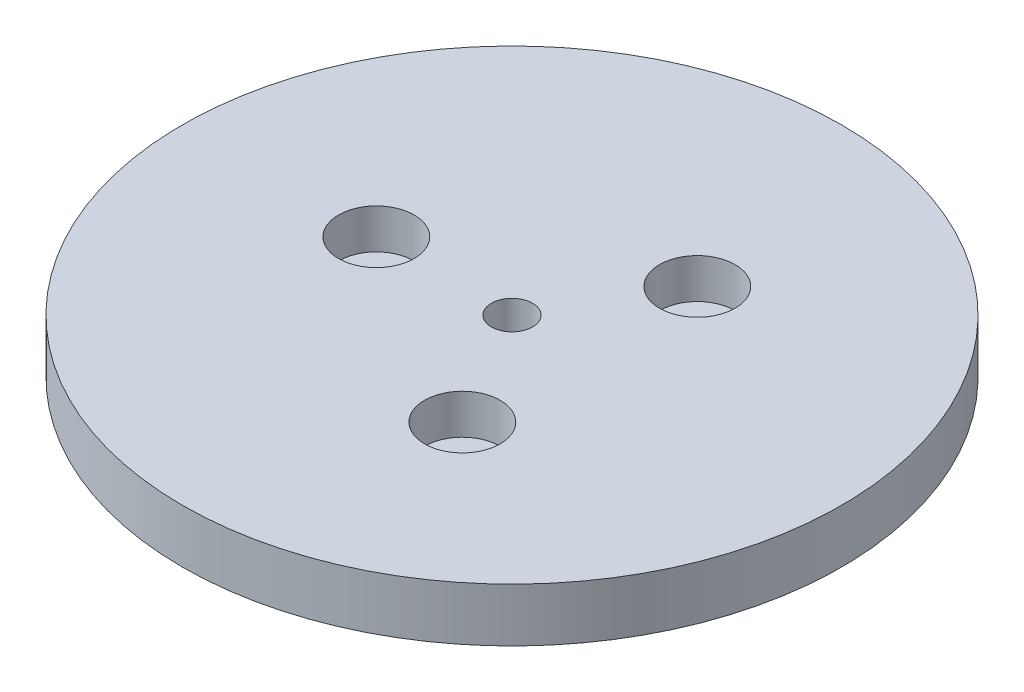
ISO-10303-21;
HEADER;
FILE_DESCRIPTION(('STEP AP214'),'2;1');
FILE_NAME('part.step','',(''),(''),'','','');
FILE_SCHEMA(('AUTOMOTIVE_DESIGN { 1 0 10303 214 1 1 1 1 }'));
ENDSEC;
DATA;
#1=APPLICATION_CONTEXT('core data for automotive mechanical design processes');
#2=APPLICATION_PROTOCOL_DEFINITION('international standard','automotive_design',2000,#1);
#3=PRODUCT_CONTEXT('',#1,'mechanical');
#4=PRODUCT('Part','Part','',(#3));
#5=PRODUCT_RELATED_PRODUCT_CATEGORY('part','',(#4));
#6=PRODUCT_DEFINITION_FORMATION('','',#4);
#7=PRODUCT_DEFINITION_CONTEXT('part definition',#1,'design');
#8=PRODUCT_DEFINITION('design','',#6,#7);
#9=PRODUCT_DEFINITION_SHAPE('','',#8);
#10=(LENGTH_UNIT() NAMED_UNIT(*) SI_UNIT(.MILLI.,.METRE.));
#11=(NAMED_UNIT(*) PLANE_ANGLE_UNIT() SI_UNIT($,.RADIAN.));
#12=(NAMED_UNIT(*) SI_UNIT($,.STERADIAN.) SOLID_ANGLE_UNIT());
#13=UNCERTAINTY_MEASURE_WITH_UNIT(LENGTH_MEASURE(1.E-05),#10,'distance_accuracy_value','');
#14=(GEOMETRIC_REPRESENTATION_CONTEXT(3) GLOBAL_UNCERTAINTY_ASSIGNED_CONTEXT((#13)) GLOBAL_UNIT_ASSIGNED_CONTEXT((#10,
#11,#12)) REPRESENTATION_CONTEXT('',''));
#15=CARTESIAN_POINT('',(0.,0.,0.));
#16=DIRECTION('',(0.,0.,1.));
#17=DIRECTION('',(1.,0.,0.));
#18=AXIS2_PLACEMENT_3D('',#15,#16,#17);
#19=CARTESIAN_POINT('',(0.,13.,0.));
#20=DIRECTION('',(0.,-1.,0.));
#21=DIRECTION('',(0.,0.,-1.));
#22=AXIS2_PLACEMENT_3D('',#19,#20,#21);
#23=CYLINDRICAL_SURFACE('',#22,80.);
#24=CARTESIAN_POINT('',(0.,13.,0.));
#25=DIRECTION('',(0.,1.,0.));
#26=DIRECTION('',(0.,0.,1.));
#27=AXIS2_PLACEMENT_3D('',#24,#25,#26);
#28=CIRCLE('',#27,80.);
#29=CARTESIAN_POINT('',(0.,13.,-80.));
#30=VERTEX_POINT('',#29);
#31=EDGE_CURVE('E10',#30,#30,#28,.T.);
#32=CARTESIAN_POINT('',(0.,0.,0.));
#33=DIRECTION('',(0.,1.,0.));
#34=DIRECTION('',(0.,0.,1.));
#35=AXIS2_PLACEMENT_3D('',#32,#33,#34);
#36=CIRCLE('',#35,80.);
#37=CARTESIAN_POINT('',(0.,0.,-80.));
#38=VERTEX_POINT('',#37);
#39=EDGE_CURVE('E37',#38,#38,#36,.T.);
#40=CARTESIAN_POINT('',(0.,13.,-80.));
#41=CARTESIAN_POINT('',(0.,12.8645833333333,-80.));
#42=CARTESIAN_POINT('',(0.,12.7291666666667,-80.));
#43=CARTESIAN_POINT('',(0.,12.4583333333333,-80.));
#44=CARTESIAN_POINT('',(0.,12.3229166666667,-80.));
#45=CARTESIAN_POINT('',(0.,12.0520833333333,-80.));
#46=CARTESIAN_POINT('',(0.,11.9166666666667,-80.));
#47=CARTESIAN_POINT('',(0.,11.6458333333333,-80.));
#48=CARTESIAN_POINT('',(0.,11.5104166666667,-80.));
#49=CARTESIAN_POINT('',(0.,11.2395833333333,-80.));
#50=CARTESIAN_POINT('',(0.,11.1041666666667,-80.));
#51=CARTESIAN_POINT('',(0.,10.8333333333333,-80.));
#52=CARTESIAN_POINT('',(0.,10.6979166666667,-80.));
#53=CARTESIAN_POINT('',(0.,10.4270833333333,-80.));
#54=CARTESIAN_POINT('',(0.,10.2916666666667,-80.));
#55=CARTESIAN_POINT('',(0.,10.0208333333333,-80.));
#56=CARTESIAN_POINT('',(0.,9.88541666666667,-80.));
#57=CARTESIAN_POINT('',(0.,9.61458333333333,-80.));
#58=CARTESIAN_POINT('',(0.,9.47916666666667,-80.));
#59=CARTESIAN_POINT('',(0.,9.20833333333333,-80.));
#60=CARTESIAN_POINT('',(0.,9.07291666666667,-80.));
#61=CARTESIAN_POINT('',(0.,8.80208333333333,-80.));
#62=CARTESIAN_POINT('',(0.,8.66666666666667,-80.));
#63=CARTESIAN_POINT('',(0.,8.39583333333333,-80.));
#64=CARTESIAN_POINT('',(0.,8.26041666666667,-80.));
#65=CARTESIAN_POINT('',(0.,7.98958333333333,-80.));
#66=CARTESIAN_POINT('',(0.,7.85416666666667,-80.));
#67=CARTESIAN_POINT('',(0.,7.58333333333333,-80.));
#68=CARTESIAN_POINT('',(0.,7.44791666666667,-80.));
#69=CARTESIAN_POINT('',(0.,7.17708333333333,-80.));
#70=CARTESIAN_POINT('',(0.,7.04166666666667,-80.));
#71=CARTESIAN_POINT('',(0.,6.77083333333333,-80.));
#72=CARTESIAN_POINT('',(0.,6.63541666666667,-80.));
#73=CARTESIAN_POINT('',(0.,6.36458333333333,-80.));
#74=CARTESIAN_POINT('',(0.,6.22916666666667,-80.));
#75=CARTESIAN_POINT('',(0.,5.95833333333333,-80.));
#76=CARTESIAN_POINT('',(0.,5.82291666666667,-80.));
#77=CARTESIAN_POINT('',(0.,5.55208333333333,-80.));
#78=CARTESIAN_POINT('',(0.,5.41666666666667,-80.));
#79=CARTESIAN_POINT('',(0.,5.14583333333333,-80.));
#80=CARTESIAN_POINT('',(0.,5.01041666666667,-80.));
#81=CARTESIAN_POINT('',(0.,4.73958333333333,-80.));
#82=CARTESIAN_POINT('',(0.,4.60416666666667,-80.));
#83=CARTESIAN_POINT('',(0.,4.33333333333333,-80.));
#84=CARTESIAN_POINT('',(0.,4.19791666666667,-80.));
#85=CARTESIAN_POINT('',(0.,3.92708333333333,-80.));
#86=CARTESIAN_POINT('',(0.,3.79166666666667,-80.));
#87=CARTESIAN_POINT('',(0.,3.52083333333333,-80.));
#88=CARTESIAN_POINT('',(0.,3.38541666666667,-80.));
#89=CARTESIAN_POINT('',(0.,3.11458333333333,-80.));
#90=CARTESIAN_POINT('',(0.,2.97916666666667,-80.));
#91=CARTESIAN_POINT('',(0.,2.70833333333333,-80.));
#92=CARTESIAN_POINT('',(0.,2.57291666666667,-80.));
#93=CARTESIAN_POINT('',(0.,2.30208333333333,-80.));
#94=CARTESIAN_POINT('',(0.,2.16666666666667,-80.));
#95=CARTESIAN_POINT('',(0.,1.89583333333333,-80.));
#96=CARTESIAN_POINT('',(0.,1.76041666666667,-80.));
#97=CARTESIAN_POINT('',(0.,1.48958333333333,-80.));
#98=CARTESIAN_POINT('',(0.,1.35416666666667,-80.));
#99=CARTESIAN_POINT('',(0.,1.08333333333333,-80.));
#100=CARTESIAN_POINT('',(0.,0.947916666666667,-80.));
#101=CARTESIAN_POINT('',(0.,0.677083333333334,-80.));
#102=CARTESIAN_POINT('',(0.,0.541666666666667,-80.));
#103=CARTESIAN_POINT('',(0.,0.270833333333334,-80.));
#104=CARTESIAN_POINT('',(0.,0.135416666666667,-80.));
#105=CARTESIAN_POINT('',(0.,0.,-80.));
#106=B_SPLINE_CURVE_WITH_KNOTS('',3,(#40,#41,#42,#43,#44,#45,#46,#47,#48,#49,#50,#51,#52,#53,
#54,#55,#56,#57,#58,#59,#60,#61,#62,#63,#64,#65,#66,#67,#68,#69,#70,#71,#72,#73,#74,#75,#76,#77,
#78,#79,#80,#81,#82,#83,#84,#85,#86,#87,#88,#89,#90,#91,#92,#93,#94,#95,#96,#97,#98,#99,#100,
#101,#102,#103,#104,#105),.UNSPECIFIED.,.F.,.F.,(4,2,2,2,2,2,2,2,2,2,2,2,2,2,2,2,2,2,2,2,2,2,2,
2,2,2,2,2,2,2,2,2,4),(0.,0.406249999999999,0.812499999999999,1.21875,1.625,2.03125,2.4375,
2.84375,3.25,3.65625,4.0625,4.46875,4.875,5.28125,5.6875,6.09375,6.5,6.90625,7.3125,7.71875,
8.125,8.53125,8.9375,9.34375,9.75,10.15625,10.5625,10.96875,11.375,11.78125,12.1875,12.59375,
13.),.UNSPECIFIED.);
#107=EDGE_CURVE('BSEAM40',#30,#38,#106,.T.);
#108=ORIENTED_EDGE('',*,*,#31,.F.);
#109=ORIENTED_EDGE('',*,*,#39,.T.);
#110=ORIENTED_EDGE('',*,*,#107,.T.);
#111=ORIENTED_EDGE('',*,*,#107,.F.);
#112=EDGE_LOOP('',(#108,#110,#109,#111));
#113=FACE_BOUND('',#112,.T.);
#114=ADVANCED_FACE('F40',(#113),#23,.T.);
#115=CARTESIAN_POINT('',(0.,13.,0.));
#116=DIRECTION('',(0.,1.,0.));
#117=DIRECTION('',(0.,0.,1.));
#118=AXIS2_PLACEMENT_3D('',#115,#116,#117);
#119=PLANE('',#118);
#120=CARTESIAN_POINT('',(16.4650314159461,13.,28.5182709606361));
#121=DIRECTION('',(0.,1.,0.));
#122=DIRECTION('',(0.866025403784436,0.,-0.500000000000004));
#123=AXIS2_PLACEMENT_3D('',#120,#121,#122);
#124=CIRCLE('',#123,9.17467919291933);
#125=CARTESIAN_POINT('',(24.4105366685867,13.,23.9309313641764));
#126=VERTEX_POINT('',#125);
#127=EDGE_CURVE('E70',#126,#126,#124,.T.);
#128=ORIENTED_EDGE('',*,*,#127,.F.);
#129=EDGE_LOOP('',(#128));
#130=FACE_BOUND('',#129,.T.);
#131=CARTESIAN_POINT('',(16.4650314159457,13.,-28.5182709606363));
#132=DIRECTION('',(0.,1.,0.));
#133=DIRECTION('',(-0.866025403784443,0.,-0.499999999999992));
#134=AXIS2_PLACEMENT_3D('',#131,#132,#133);
#135=CIRCLE('',#134,9.17467919291933);
#136=CARTESIAN_POINT('',(8.519526163305,13.,-33.1056105570959));
#137=VERTEX_POINT('',#136);
#138=EDGE_CURVE('E61',#137,#137,#135,.T.);
#139=ORIENTED_EDGE('',*,*,#138,.F.);
#140=EDGE_LOOP('',(#139));
#141=FACE_BOUND('',#140,.T.);
#142=CARTESIAN_POINT('',(-32.9300628318919,13.,0.));
#143=DIRECTION('',(0.,1.,0.));
#144=DIRECTION('',(0.,0.,1.));
#145=AXIS2_PLACEMENT_3D('',#142,#143,#144);
#146=CIRCLE('',#145,9.17467919291933);
#147=CARTESIAN_POINT('',(-32.9300628318919,13.,9.17467919291933));
#148=VERTEX_POINT('',#147);
#149=EDGE_CURVE('E54',#148,#148,#146,.T.);
#150=ORIENTED_EDGE('',*,*,#149,.F.);
#151=EDGE_LOOP('',(#150));
#152=FACE_BOUND('',#151,.T.);
#153=CARTESIAN_POINT('',(0.,13.,0.));
#154=DIRECTION('',(0.,1.,0.));
#155=DIRECTION('',(0.,0.,1.));
#156=AXIS2_PLACEMENT_3D('',#153,#154,#155);
#157=CIRCLE('',#156,5.);
#158=CARTESIAN_POINT('',(0.,13.,-5.));
#159=VERTEX_POINT('',#158);
#160=EDGE_CURVE('E50',#159,#159,#157,.T.);
#161=ORIENTED_EDGE('',*,*,#160,.F.);
#162=EDGE_LOOP('',(#161));
#163=FACE_BOUND('',#162,.T.);
#164=ORIENTED_EDGE('',*,*,#31,.T.);
#165=EDGE_LOOP('',(#164));
#166=FACE_BOUND('',#165,.T.);
#167=ADVANCED_FACE('F85',(#130,#141,#152,#163,#166),#119,.T.);
#168=CARTESIAN_POINT('',(0.,0.,0.));
#169=DIRECTION('',(0.,1.,0.));
#170=DIRECTION('',(0.,0.,1.));
#171=AXIS2_PLACEMENT_3D('',#168,#169,#170);
#172=PLANE('',#171);
#173=CARTESIAN_POINT('',(0.,0.,0.));
#174=DIRECTION('',(0.,1.,0.));
#175=DIRECTION('',(0.,0.,1.));
#176=AXIS2_PLACEMENT_3D('',#173,#174,#175);
#177=CIRCLE('',#176,5.);
#178=CARTESIAN_POINT('',(0.,0.,-5.));
#179=VERTEX_POINT('',#178);
#180=EDGE_CURVE('E47',#179,#179,#177,.T.);
#181=ORIENTED_EDGE('',*,*,#180,.T.);
#182=EDGE_LOOP('',(#181));
#183=FACE_BOUND('',#182,.T.);
#184=ORIENTED_EDGE('',*,*,#39,.F.);
#185=EDGE_LOOP('',(#184));
#186=FACE_BOUND('',#185,.T.);
#187=ADVANCED_FACE('F84',(#183,#186),#172,.F.);
#188=CARTESIAN_POINT('',(0.,13.,0.));
#189=DIRECTION('',(0.,-1.,0.));
#190=DIRECTION('',(0.,0.,-1.));
#191=AXIS2_PLACEMENT_3D('',#188,#189,#190);
#192=CYLINDRICAL_SURFACE('',#191,5.);
#193=CARTESIAN_POINT('',(0.,13.,-5.));
#194=CARTESIAN_POINT('',(0.,12.8645833333333,-5.));
#195=CARTESIAN_POINT('',(0.,12.7291666666667,-5.));
#196=CARTESIAN_POINT('',(0.,12.4583333333333,-5.));
#197=CARTESIAN_POINT('',(0.,12.3229166666667,-5.));
#198=CARTESIAN_POINT('',(0.,12.0520833333333,-5.));
#199=CARTESIAN_POINT('',(0.,11.9166666666667,-5.));
#200=CARTESIAN_POINT('',(0.,11.6458333333333,-5.));
#201=CARTESIAN_POINT('',(0.,11.5104166666667,-5.));
#202=CARTESIAN_POINT('',(0.,11.2395833333333,-5.));
#203=CARTESIAN_POINT('',(0.,11.1041666666667,-5.));
#204=CARTESIAN_POINT('',(0.,10.8333333333333,-5.));
#205=CARTESIAN_POINT('',(0.,10.6979166666667,-5.));
#206=CARTESIAN_POINT('',(0.,10.4270833333333,-5.));
#207=CARTESIAN_POINT('',(0.,10.2916666666667,-5.));
#208=CARTESIAN_POINT('',(0.,10.0208333333333,-5.));
#209=CARTESIAN_POINT('',(0.,9.88541666666667,-5.));
#210=CARTESIAN_POINT('',(0.,9.61458333333333,-5.));
#211=CARTESIAN_POINT('',(0.,9.47916666666667,-5.));
#212=CARTESIAN_POINT('',(0.,9.20833333333333,-5.));
#213=CARTESIAN_POINT('',(0.,9.07291666666667,-5.));
#214=CARTESIAN_POINT('',(0.,8.80208333333333,-5.));
#215=CARTESIAN_POINT('',(0.,8.66666666666667,-5.));
#216=CARTESIAN_POINT('',(0.,8.39583333333333,-5.));
#217=CARTESIAN_POINT('',(0.,8.26041666666667,-5.));
#218=CARTESIAN_POINT('',(0.,7.98958333333333,-5.));
#219=CARTESIAN_POINT('',(0.,7.85416666666667,-5.));
#220=CARTESIAN_POINT('',(0.,7.58333333333333,-5.));
#221=CARTESIAN_POINT('',(0.,7.44791666666667,-5.));
#222=CARTESIAN_POINT('',(0.,7.17708333333333,-5.));
#223=CARTESIAN_POINT('',(0.,7.04166666666667,-5.));
#224=CARTESIAN_POINT('',(0.,6.77083333333333,-5.));
#225=CARTESIAN_POINT('',(0.,6.63541666666667,-5.));
#226=CARTESIAN_POINT('',(0.,6.36458333333333,-5.));
#227=CARTESIAN_POINT('',(0.,6.22916666666667,-5.));
#228=CARTESIAN_POINT('',(0.,5.95833333333333,-5.));
#229=CARTESIAN_POINT('',(0.,5.82291666666667,-5.));
#230=CARTESIAN_POINT('',(0.,5.55208333333333,-5.));
#231=CARTESIAN_POINT('',(0.,5.41666666666667,-5.));
#232=CARTESIAN_POINT('',(0.,5.14583333333333,-5.));
#233=CARTESIAN_POINT('',(0.,5.01041666666667,-5.));
#234=CARTESIAN_POINT('',(0.,4.73958333333333,-5.));
#235=CARTESIAN_POINT('',(0.,4.60416666666667,-5.));
#236=CARTESIAN_POINT('',(0.,4.33333333333333,-5.));
#237=CARTESIAN_POINT('',(0.,4.19791666666667,-5.));
#238=CARTESIAN_POINT('',(0.,3.92708333333333,-5.));
#239=CARTESIAN_POINT('',(0.,3.79166666666667,-5.));
#240=CARTESIAN_POINT('',(0.,3.52083333333333,-5.));
#241=CARTESIAN_POINT('',(0.,3.38541666666667,-5.));
#242=CARTESIAN_POINT('',(0.,3.11458333333333,-5.));
#243=CARTESIAN_POINT('',(0.,2.97916666666667,-5.));
#244=CARTESIAN_POINT('',(0.,2.70833333333333,-5.));
#245=CARTESIAN_POINT('',(0.,2.57291666666667,-5.));
#246=CARTESIAN_POINT('',(0.,2.30208333333333,-5.));
#247=CARTESIAN_POINT('',(0.,2.16666666666667,-5.));
#248=CARTESIAN_POINT('',(0.,1.89583333333333,-5.));
#249=CARTESIAN_POINT('',(0.,1.76041666666667,-5.));
#250=CARTESIAN_POINT('',(0.,1.48958333333333,-5.));
#251=CARTESIAN_POINT('',(0.,1.35416666666667,-5.));
#252=CARTESIAN_POINT('',(0.,1.08333333333333,-5.));
#253=CARTESIAN_POINT('',(0.,0.947916666666667,-5.));
#254=CARTESIAN_POINT('',(0.,0.677083333333334,-5.));
#255=CARTESIAN_POINT('',(0.,0.541666666666667,-5.));
#256=CARTESIAN_POINT('',(0.,0.270833333333334,-5.));
#257=CARTESIAN_POINT('',(0.,0.135416666666667,-5.));
#258=CARTESIAN_POINT('',(0.,0.,-5.));
#259=B_SPLINE_CURVE_WITH_KNOTS('',3,(#193,#194,#195,#196,#197,#198,#199,#200,#201,#202,#203,
#204,#205,#206,#207,#208,#209,#210,#211,#212,#213,#214,#215,#216,#217,#218,#219,#220,#221,#222,
#223,#224,#225,#226,#227,#228,#229,#230,#231,#232,#233,#234,#235,#236,#237,#238,#239,#240,#241,
#242,#243,#244,#245,#246,#247,#248,#249,#250,#251,#252,#253,#254,#255,#256,#257,#258),
.UNSPECIFIED.,.F.,.F.,(4,2,2,2,2,2,2,2,2,2,2,2,2,2,2,2,2,2,2,2,2,2,2,2,2,2,2,2,2,2,2,2,4),(0.,
0.406249999999999,0.812499999999999,1.21875,1.625,2.03125,2.4375,2.84375,3.25,3.65625,4.0625,
4.46875,4.875,5.28125,5.6875,6.09375,6.5,6.90625,7.3125,7.71875,8.125,8.53125,8.9375,9.34375,
9.75,10.15625,10.5625,10.96875,11.375,11.78125,12.1875,12.59375,13.),.UNSPECIFIED.);
#260=EDGE_CURVE('BSEAM91',#159,#179,#259,.T.);
#261=ORIENTED_EDGE('',*,*,#160,.T.);
#262=ORIENTED_EDGE('',*,*,#180,.F.);
#263=ORIENTED_EDGE('',*,*,#260,.T.);
#264=ORIENTED_EDGE('',*,*,#260,.F.);
#265=EDGE_LOOP('',(#261,#263,#262,#264));
#266=FACE_BOUND('',#265,.T.);
#267=ADVANCED_FACE('F91',(#266),#192,.F.);
#268=CARTESIAN_POINT('',(-32.9300628318919,3.33120211531361,0.));
#269=DIRECTION('',(0.,1.,0.));
#270=DIRECTION('',(0.,0.,1.));
#271=AXIS2_PLACEMENT_3D('',#268,#269,#270);
#272=CYLINDRICAL_SURFACE('',#271,9.17467919291933);
#273=CARTESIAN_POINT('',(-32.9300628318919,3.33120211531361,0.));
#274=DIRECTION('',(0.,1.,0.));
#275=DIRECTION('',(0.,0.,1.));
#276=AXIS2_PLACEMENT_3D('',#273,#274,#275);
#277=CIRCLE('',#276,9.17467919291933);
#278=CARTESIAN_POINT('',(-32.9300628318919,3.33120211531361,9.17467919291933));
#279=VERTEX_POINT('',#278);
#280=EDGE_CURVE('E55',#279,#279,#277,.T.);
#281=ORIENTED_EDGE('',*,*,#280,.F.);
#282=EDGE_LOOP('',(#281));
#283=FACE_BOUND('',#282,.T.);
#284=ORIENTED_EDGE('',*,*,#149,.T.);
#285=EDGE_LOOP('',(#284));
#286=FACE_BOUND('',#285,.T.);
#287=ADVANCED_FACE('F96',(#283,#286),#272,.F.);
#288=CARTESIAN_POINT('',(-32.9300628318919,3.33120211531361,0.));
#289=DIRECTION('',(0.,1.,0.));
#290=DIRECTION('',(0.,0.,1.));
#291=AXIS2_PLACEMENT_3D('',#288,#289,#290);
#292=PLANE('',#291);
#293=ORIENTED_EDGE('',*,*,#280,.T.);
#294=EDGE_LOOP('',(#293));
#295=FACE_BOUND('',#294,.T.);
#296=ADVANCED_FACE('F127',(#295),#292,.T.);
#297=CARTESIAN_POINT('',(16.4650314159457,3.33120211531361,-28.5182709606363));
#298=DIRECTION('',(0.,1.,0.));
#299=DIRECTION('',(0.,0.,1.));
#300=AXIS2_PLACEMENT_3D('',#297,#298,#299);
#301=CYLINDRICAL_SURFACE('',#300,9.17467919291933);
#302=CARTESIAN_POINT('',(16.4650314159457,3.33120211531361,-28.5182709606363));
#303=DIRECTION('',(0.,1.,0.));
#304=DIRECTION('',(-0.866025403784443,0.,-0.499999999999992));
#305=AXIS2_PLACEMENT_3D('',#302,#303,#304);
#306=CIRCLE('',#305,9.17467919291933);
#307=CARTESIAN_POINT('',(8.519526163305,3.33120211531361,-33.1056105570959));
#308=VERTEX_POINT('',#307);
#309=EDGE_CURVE('E63',#308,#308,#306,.T.);
#310=ORIENTED_EDGE('',*,*,#309,.F.);
#311=EDGE_LOOP('',(#310));
#312=FACE_BOUND('',#311,.T.);
#313=ORIENTED_EDGE('',*,*,#138,.T.);
#314=EDGE_LOOP('',(#313));
#315=FACE_BOUND('',#314,.T.);
#316=ADVANCED_FACE('F133',(#312,#315),#301,.F.);
#317=CARTESIAN_POINT('',(16.4650314159457,3.33120211531361,-28.5182709606363));
#318=DIRECTION('',(0.,1.,0.));
#319=DIRECTION('',(-0.866025403784443,0.,-0.499999999999992));
#320=AXIS2_PLACEMENT_3D('',#317,#318,#319);
#321=PLANE('',#320);
#322=ORIENTED_EDGE('',*,*,#309,.T.);
#323=EDGE_LOOP('',(#322));
#324=FACE_BOUND('',#323,.T.);
#325=ADVANCED_FACE('F77',(#324),#321,.T.);
#326=CARTESIAN_POINT('',(16.4650314159461,3.33120211531361,28.5182709606361));
#327=DIRECTION('',(0.,1.,0.));
#328=DIRECTION('',(0.,0.,1.));
#329=AXIS2_PLACEMENT_3D('',#326,#327,#328);
#330=CYLINDRICAL_SURFACE('',#329,9.17467919291933);
#331=CARTESIAN_POINT('',(16.4650314159461,3.33120211531361,28.5182709606361));
#332=DIRECTION('',(0.,1.,0.));
#333=DIRECTION('',(0.866025403784436,0.,-0.500000000000004));
#334=AXIS2_PLACEMENT_3D('',#331,#332,#333);
#335=CIRCLE('',#334,9.17467919291933);
#336=CARTESIAN_POINT('',(24.4105366685867,3.33120211531361,23.9309313641764));
#337=VERTEX_POINT('',#336);
#338=EDGE_CURVE('E59',#337,#337,#335,.T.);
#339=ORIENTED_EDGE('',*,*,#338,.F.);
#340=EDGE_LOOP('',(#339));
#341=FACE_BOUND('',#340,.T.);
#342=ORIENTED_EDGE('',*,*,#127,.T.);
#343=EDGE_LOOP('',(#342));
#344=FACE_BOUND('',#343,.T.);
#345=ADVANCED_FACE('F73',(#341,#344),#330,.F.);
#346=CARTESIAN_POINT('',(16.4650314159461,3.33120211531361,28.5182709606361));
#347=DIRECTION('',(0.,1.,0.));
#348=DIRECTION('',(0.866025403784436,0.,-0.500000000000004));
#349=AXIS2_PLACEMENT_3D('',#346,#347,#348);
#350=PLANE('',#349);
#351=ORIENTED_EDGE('',*,*,#338,.T.);
#352=EDGE_LOOP('',(#351));
#353=FACE_BOUND('',#352,.T.);
#354=ADVANCED_FACE('F71',(#353),#350,.T.);
#355=CLOSED_SHELL('',(#114,#167,#187,#267,#287,#296,#316,#325,#345,#354));
#356=MANIFOLD_SOLID_BREP('B2',#355);
#357=ADVANCED_BREP_SHAPE_REPRESENTATION('',(#18,#356),#14);
#358=SHAPE_DEFINITION_REPRESENTATION(#9,#357);
ENDSEC;
END-ISO-10303-21;
